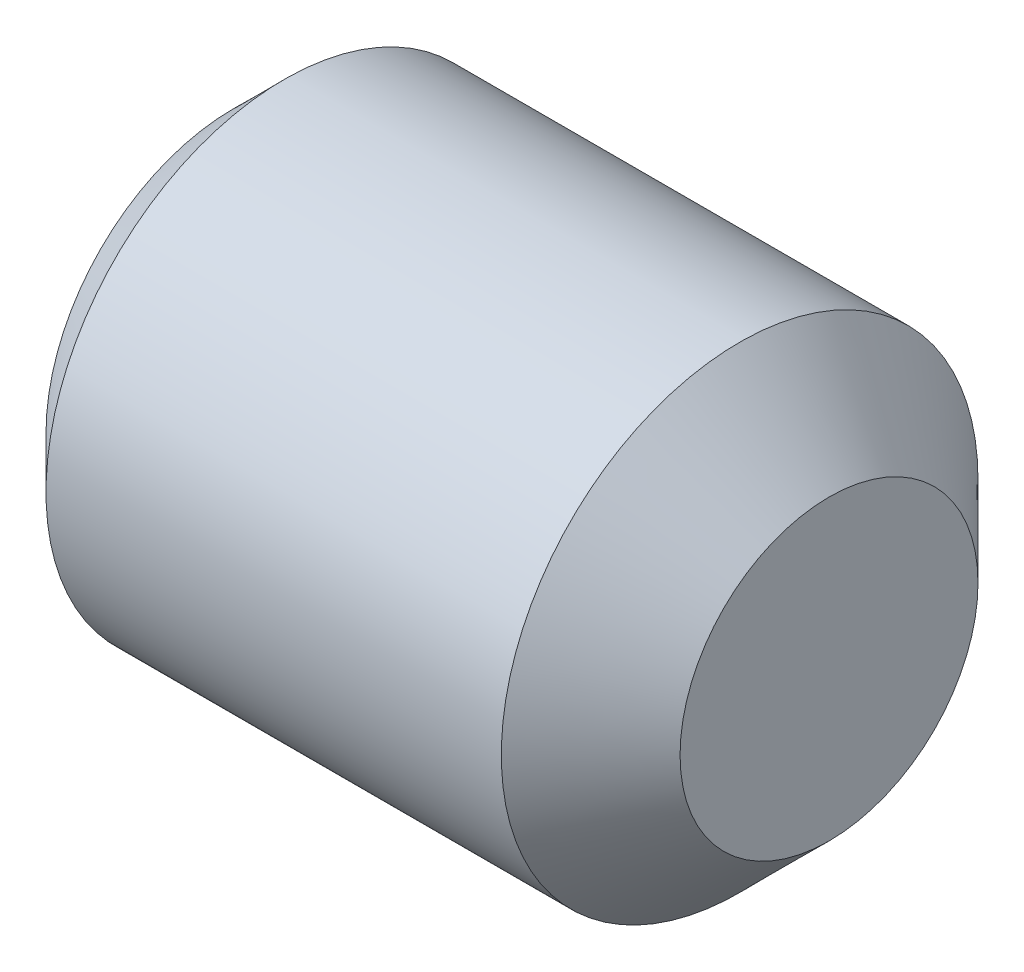
ISO-10303-21;
HEADER;
FILE_DESCRIPTION(('STEP AP214'),'2;1');
FILE_NAME('part.step','',(''),(''),'','','');
FILE_SCHEMA(('AUTOMOTIVE_DESIGN { 1 0 10303 214 1 1 1 1 }'));
ENDSEC;
DATA;
#1=APPLICATION_CONTEXT('core data for automotive mechanical design processes');
#2=APPLICATION_PROTOCOL_DEFINITION('international standard','automotive_design',2000,#1);
#3=PRODUCT_CONTEXT('',#1,'mechanical');
#4=PRODUCT('Part','Part','',(#3));
#5=PRODUCT_RELATED_PRODUCT_CATEGORY('part','',(#4));
#6=PRODUCT_DEFINITION_FORMATION('','',#4);
#7=PRODUCT_DEFINITION_CONTEXT('part definition',#1,'design');
#8=PRODUCT_DEFINITION('design','',#6,#7);
#9=PRODUCT_DEFINITION_SHAPE('','',#8);
#10=(LENGTH_UNIT() NAMED_UNIT(*) SI_UNIT(.MILLI.,.METRE.));
#11=(NAMED_UNIT(*) PLANE_ANGLE_UNIT() SI_UNIT($,.RADIAN.));
#12=(NAMED_UNIT(*) SI_UNIT($,.STERADIAN.) SOLID_ANGLE_UNIT());
#13=UNCERTAINTY_MEASURE_WITH_UNIT(LENGTH_MEASURE(1.E-05),#10,'distance_accuracy_value','');
#14=(GEOMETRIC_REPRESENTATION_CONTEXT(3) GLOBAL_UNCERTAINTY_ASSIGNED_CONTEXT((#13)) GLOBAL_UNIT_ASSIGNED_CONTEXT((#10,
#11,#12)) REPRESENTATION_CONTEXT('',''));
#15=CARTESIAN_POINT('',(0.,0.,0.));
#16=DIRECTION('',(0.,0.,1.));
#17=DIRECTION('',(1.,0.,0.));
#18=AXIS2_PLACEMENT_3D('',#15,#16,#17);
#19=CARTESIAN_POINT('',(0.,0.,0.));
#20=DIRECTION('',(1.,0.,0.));
#21=DIRECTION('',(0.,1.,0.));
#22=AXIS2_PLACEMENT_3D('',#19,#20,#21);
#23=PLANE('',#22);
#24=CARTESIAN_POINT('',(0.,0.,0.));
#25=DIRECTION('',(-1.,0.,0.));
#26=DIRECTION('',(0.,0.,-1.));
#27=AXIS2_PLACEMENT_3D('',#24,#25,#26);
#28=CIRCLE('',#27,1.);
#29=CARTESIAN_POINT('',(0.,-0.866025403784439,-0.5));
#30=VERTEX_POINT('',#29);
#31=CARTESIAN_POINT('',(0.,-0.866025403784439,0.5));
#32=VERTEX_POINT('',#31);
#33=EDGE_CURVE('E41',#30,#32,#28,.T.);
#34=ORIENTED_EDGE('',*,*,#33,.F.);
#35=DIRECTION('',(0.,0.5,-0.866025403784439));
#36=VECTOR('',#35,1.);
#37=CARTESIAN_POINT('',(0.,-1.15470053837925,0.));
#38=LINE('',#37,#36);
#39=CARTESIAN_POINT('',(0.,-1.15470053837925,0.));
#40=VERTEX_POINT('',#39);
#41=EDGE_CURVE('E20',#40,#30,#38,.T.);
#42=ORIENTED_EDGE('',*,*,#41,.F.);
#43=DIRECTION('',(0.,-0.5,-0.866025403784439));
#44=VECTOR('',#43,1.);
#45=CARTESIAN_POINT('',(0.,-0.577350269189626,1.));
#46=LINE('',#45,#44);
#47=EDGE_CURVE('E183',#32,#40,#46,.T.);
#48=ORIENTED_EDGE('',*,*,#47,.F.);
#49=EDGE_LOOP('',(#34,#42,#48));
#50=FACE_BOUND('',#49,.T.);
#51=ADVANCED_FACE('F16',(#50),#23,.F.);
#52=CARTESIAN_POINT('',(0.,0.,0.));
#53=DIRECTION('',(1.,0.,0.));
#54=DIRECTION('',(0.,1.,0.));
#55=AXIS2_PLACEMENT_3D('',#52,#53,#54);
#56=PLANE('',#55);
#57=CARTESIAN_POINT('',(0.,0.,0.));
#58=DIRECTION('',(-1.,0.,0.));
#59=DIRECTION('',(0.,0.,-1.));
#60=AXIS2_PLACEMENT_3D('',#57,#58,#59);
#61=CIRCLE('',#60,1.);
#62=CARTESIAN_POINT('',(0.,0.,1.));
#63=VERTEX_POINT('',#62);
#64=EDGE_CURVE('E172',#32,#63,#61,.T.);
#65=ORIENTED_EDGE('',*,*,#64,.F.);
#66=DIRECTION('',(0.,-0.5,-0.866025403784439));
#67=VECTOR('',#66,1.);
#68=CARTESIAN_POINT('',(0.,-0.577350269189626,1.));
#69=LINE('',#68,#67);
#70=CARTESIAN_POINT('',(0.,-0.577350269189626,1.));
#71=VERTEX_POINT('',#70);
#72=EDGE_CURVE('E179',#71,#32,#69,.T.);
#73=ORIENTED_EDGE('',*,*,#72,.F.);
#74=DIRECTION('',(0.,-1.,0.));
#75=VECTOR('',#74,1.);
#76=CARTESIAN_POINT('',(0.,0.577350269189626,1.));
#77=LINE('',#76,#75);
#78=EDGE_CURVE('E193',#63,#71,#77,.T.);
#79=ORIENTED_EDGE('',*,*,#78,.F.);
#80=EDGE_LOOP('',(#65,#73,#79));
#81=FACE_BOUND('',#80,.T.);
#82=ADVANCED_FACE('F428',(#81),#56,.F.);
#83=CARTESIAN_POINT('',(0.,0.,0.));
#84=DIRECTION('',(1.,0.,0.));
#85=DIRECTION('',(0.,1.,0.));
#86=AXIS2_PLACEMENT_3D('',#83,#84,#85);
#87=PLANE('',#86);
#88=CARTESIAN_POINT('',(0.,0.,0.));
#89=DIRECTION('',(-1.,0.,0.));
#90=DIRECTION('',(0.,0.,-1.));
#91=AXIS2_PLACEMENT_3D('',#88,#89,#90);
#92=CIRCLE('',#91,1.);
#93=CARTESIAN_POINT('',(0.,0.866025403784439,0.5));
#94=VERTEX_POINT('',#93);
#95=EDGE_CURVE('E199',#63,#94,#92,.T.);
#96=ORIENTED_EDGE('',*,*,#95,.F.);
#97=DIRECTION('',(0.,-1.,0.));
#98=VECTOR('',#97,1.);
#99=CARTESIAN_POINT('',(0.,0.577350269189626,1.));
#100=LINE('',#99,#98);
#101=CARTESIAN_POINT('',(0.,0.577350269189626,1.));
#102=VERTEX_POINT('',#101);
#103=EDGE_CURVE('E188',#102,#63,#100,.T.);
#104=ORIENTED_EDGE('',*,*,#103,.F.);
#105=DIRECTION('',(0.,-0.5,0.866025403784439));
#106=VECTOR('',#105,1.);
#107=CARTESIAN_POINT('',(0.,1.15470053837925,0.));
#108=LINE('',#107,#106);
#109=EDGE_CURVE('E138',#94,#102,#108,.T.);
#110=ORIENTED_EDGE('',*,*,#109,.F.);
#111=EDGE_LOOP('',(#96,#104,#110));
#112=FACE_BOUND('',#111,.T.);
#113=ADVANCED_FACE('F423',(#112),#87,.F.);
#114=CARTESIAN_POINT('',(0.,0.,0.));
#115=DIRECTION('',(1.,0.,0.));
#116=DIRECTION('',(0.,1.,0.));
#117=AXIS2_PLACEMENT_3D('',#114,#115,#116);
#118=PLANE('',#117);
#119=CARTESIAN_POINT('',(0.,0.,0.));
#120=DIRECTION('',(-1.,0.,0.));
#121=DIRECTION('',(0.,0.,-1.));
#122=AXIS2_PLACEMENT_3D('',#119,#120,#121);
#123=CIRCLE('',#122,1.);
#124=CARTESIAN_POINT('',(0.,0.866025403784439,-0.5));
#125=VERTEX_POINT('',#124);
#126=EDGE_CURVE('E131',#94,#125,#123,.T.);
#127=ORIENTED_EDGE('',*,*,#126,.F.);
#128=DIRECTION('',(0.,-0.5,0.866025403784439));
#129=VECTOR('',#128,1.);
#130=CARTESIAN_POINT('',(0.,1.15470053837925,0.));
#131=LINE('',#130,#129);
#132=CARTESIAN_POINT('',(0.,1.15470053837925,0.));
#133=VERTEX_POINT('',#132);
#134=EDGE_CURVE('E126',#133,#94,#131,.T.);
#135=ORIENTED_EDGE('',*,*,#134,.F.);
#136=DIRECTION('',(0.,0.5,0.866025403784439));
#137=VECTOR('',#136,1.);
#138=CARTESIAN_POINT('',(0.,0.577350269189626,-1.));
#139=LINE('',#138,#137);
#140=EDGE_CURVE('E129',#125,#133,#139,.T.);
#141=ORIENTED_EDGE('',*,*,#140,.F.);
#142=EDGE_LOOP('',(#127,#135,#141));
#143=FACE_BOUND('',#142,.T.);
#144=ADVANCED_FACE('F128',(#143),#118,.F.);
#145=CARTESIAN_POINT('',(0.,0.,0.));
#146=DIRECTION('',(1.,0.,0.));
#147=DIRECTION('',(0.,1.,0.));
#148=AXIS2_PLACEMENT_3D('',#145,#146,#147);
#149=PLANE('',#148);
#150=CARTESIAN_POINT('',(0.,0.,0.));
#151=DIRECTION('',(-1.,0.,0.));
#152=DIRECTION('',(0.,0.,-1.));
#153=AXIS2_PLACEMENT_3D('',#150,#151,#152);
#154=CIRCLE('',#153,1.);
#155=CARTESIAN_POINT('',(0.,0.,-1.));
#156=VERTEX_POINT('',#155);
#157=EDGE_CURVE('E235',#156,#30,#154,.T.);
#158=ORIENTED_EDGE('',*,*,#157,.F.);
#159=DIRECTION('',(0.,1.,0.));
#160=VECTOR('',#159,1.);
#161=CARTESIAN_POINT('',(0.,-0.577350269189626,-1.));
#162=LINE('',#161,#160);
#163=CARTESIAN_POINT('',(0.,-0.577350269189626,-1.));
#164=VERTEX_POINT('',#163);
#165=EDGE_CURVE('E161',#164,#156,#162,.T.);
#166=ORIENTED_EDGE('',*,*,#165,.F.);
#167=DIRECTION('',(0.,0.5,-0.866025403784439));
#168=VECTOR('',#167,1.);
#169=CARTESIAN_POINT('',(0.,-1.15470053837925,0.));
#170=LINE('',#169,#168);
#171=EDGE_CURVE('E204',#30,#164,#170,.T.);
#172=ORIENTED_EDGE('',*,*,#171,.F.);
#173=EDGE_LOOP('',(#158,#166,#172));
#174=FACE_BOUND('',#173,.T.);
#175=ADVANCED_FACE('F399',(#174),#149,.F.);
#176=CARTESIAN_POINT('',(-2.5,0.,0.));
#177=DIRECTION('',(1.,0.,0.));
#178=DIRECTION('',(0.,1.,0.));
#179=AXIS2_PLACEMENT_3D('',#176,#177,#178);
#180=PLANE('',#179);
#181=CARTESIAN_POINT('',(-2.5,0.,0.));
#182=DIRECTION('',(1.,0.,0.));
#183=DIRECTION('',(0.,0.,-1.));
#184=AXIS2_PLACEMENT_3D('',#181,#182,#183);
#185=CIRCLE('',#184,1.5705);
#186=CARTESIAN_POINT('',(-2.5,0.,-1.5705));
#187=VERTEX_POINT('',#186);
#188=EDGE_CURVE('E167',#187,#187,#185,.T.);
#189=ORIENTED_EDGE('',*,*,#188,.F.);
#190=EDGE_LOOP('',(#189));
#191=FACE_BOUND('',#190,.T.);
#192=DIRECTION('',(0.,-1.,0.));
#193=VECTOR('',#192,1.);
#194=CARTESIAN_POINT('',(-2.5,0.577350269189626,1.));
#195=LINE('',#194,#193);
#196=CARTESIAN_POINT('',(-2.5,0.577350269189626,1.));
#197=VERTEX_POINT('',#196);
#198=CARTESIAN_POINT('',(-2.5,-0.577350269189626,1.));
#199=VERTEX_POINT('',#198);
#200=EDGE_CURVE('E11',#197,#199,#195,.T.);
#201=ORIENTED_EDGE('',*,*,#200,.T.);
#202=DIRECTION('',(0.,-0.5,-0.866025403784439));
#203=VECTOR('',#202,1.);
#204=CARTESIAN_POINT('',(-2.5,-0.577350269189626,1.));
#205=LINE('',#204,#203);
#206=CARTESIAN_POINT('',(-2.5,-1.15470053837925,0.));
#207=VERTEX_POINT('',#206);
#208=EDGE_CURVE('E27',#199,#207,#205,.T.);
#209=ORIENTED_EDGE('',*,*,#208,.T.);
#210=DIRECTION('',(0.,0.5,-0.866025403784439));
#211=VECTOR('',#210,1.);
#212=CARTESIAN_POINT('',(-2.5,-1.15470053837925,0.));
#213=LINE('',#212,#211);
#214=CARTESIAN_POINT('',(-2.5,-0.577350269189626,-1.));
#215=VERTEX_POINT('',#214);
#216=EDGE_CURVE('E223',#207,#215,#213,.T.);
#217=ORIENTED_EDGE('',*,*,#216,.T.);
#218=DIRECTION('',(0.,1.,0.));
#219=VECTOR('',#218,1.);
#220=CARTESIAN_POINT('',(-2.5,-0.577350269189626,-1.));
#221=LINE('',#220,#219);
#222=CARTESIAN_POINT('',(-2.5,0.577350269189626,-1.));
#223=VERTEX_POINT('',#222);
#224=EDGE_CURVE('E219',#215,#223,#221,.T.);
#225=ORIENTED_EDGE('',*,*,#224,.T.);
#226=DIRECTION('',(0.,0.5,0.866025403784439));
#227=VECTOR('',#226,1.);
#228=CARTESIAN_POINT('',(-2.5,0.577350269189626,-1.));
#229=LINE('',#228,#227);
#230=CARTESIAN_POINT('',(-2.5,1.15470053837925,0.));
#231=VERTEX_POINT('',#230);
#232=EDGE_CURVE('E224',#223,#231,#229,.T.);
#233=ORIENTED_EDGE('',*,*,#232,.T.);
#234=DIRECTION('',(0.,-0.5,0.866025403784439));
#235=VECTOR('',#234,1.);
#236=CARTESIAN_POINT('',(-2.5,1.15470053837925,0.));
#237=LINE('',#236,#235);
#238=EDGE_CURVE('E150',#231,#197,#237,.T.);
#239=ORIENTED_EDGE('',*,*,#238,.T.);
#240=EDGE_LOOP('',(#201,#209,#217,#225,#233,#239));
#241=FACE_BOUND('',#240,.T.);
#242=ADVANCED_FACE('F260',(#191,#241),#180,.F.);
#243=CARTESIAN_POINT('',(-2.5,0.,0.));
#244=DIRECTION('',(1.,0.,0.));
#245=DIRECTION('',(0.,0.,-1.));
#246=AXIS2_PLACEMENT_3D('',#243,#244,#245);
#247=CONICAL_SURFACE('',#246,1.5705,0.785398163397448);
#248=CARTESIAN_POINT('',(-2.0705,0.,0.));
#249=DIRECTION('',(1.,0.,0.));
#250=DIRECTION('',(0.,0.,-1.));
#251=AXIS2_PLACEMENT_3D('',#248,#249,#250);
#252=CIRCLE('',#251,2.);
#253=CARTESIAN_POINT('',(-2.0705,0.,-2.));
#254=VERTEX_POINT('',#253);
#255=EDGE_CURVE('E171',#254,#254,#252,.T.);
#256=ORIENTED_EDGE('',*,*,#255,.F.);
#257=EDGE_LOOP('',(#256));
#258=FACE_BOUND('',#257,.T.);
#259=ORIENTED_EDGE('',*,*,#188,.T.);
#260=EDGE_LOOP('',(#259));
#261=FACE_BOUND('',#260,.T.);
#262=ADVANCED_FACE('F18',(#258,#261),#247,.T.);
#263=CARTESIAN_POINT('',(2.5,0.,0.));
#264=DIRECTION('',(1.,0.,0.));
#265=DIRECTION('',(0.,0.,-1.));
#266=AXIS2_PLACEMENT_3D('',#263,#264,#265);
#267=CYLINDRICAL_SURFACE('',#266,2.);
#268=CARTESIAN_POINT('',(1.75,0.,0.));
#269=DIRECTION('',(1.,0.,0.));
#270=DIRECTION('',(0.,0.,-1.));
#271=AXIS2_PLACEMENT_3D('',#268,#269,#270);
#272=CIRCLE('',#271,2.);
#273=CARTESIAN_POINT('',(1.75,0.,-2.));
#274=VERTEX_POINT('',#273);
#275=EDGE_CURVE('E178',#274,#274,#272,.T.);
#276=ORIENTED_EDGE('',*,*,#275,.F.);
#277=EDGE_LOOP('',(#276));
#278=FACE_BOUND('',#277,.T.);
#279=ORIENTED_EDGE('',*,*,#255,.T.);
#280=EDGE_LOOP('',(#279));
#281=FACE_BOUND('',#280,.T.);
#282=ADVANCED_FACE('F373',(#278,#281),#267,.T.);
#283=CARTESIAN_POINT('',(1.75,0.,0.));
#284=DIRECTION('',(-1.,0.,0.));
#285=DIRECTION('',(0.,0.,1.));
#286=AXIS2_PLACEMENT_3D('',#283,#284,#285);
#287=CONICAL_SURFACE('',#286,2.,0.785398163397449);
#288=CARTESIAN_POINT('',(2.5,0.,0.));
#289=DIRECTION('',(1.,0.,0.));
#290=DIRECTION('',(0.,0.,-1.));
#291=AXIS2_PLACEMENT_3D('',#288,#289,#290);
#292=CIRCLE('',#291,1.25);
#293=CARTESIAN_POINT('',(2.5,0.,-1.25));
#294=VERTEX_POINT('',#293);
#295=EDGE_CURVE('E192',#294,#294,#292,.T.);
#296=ORIENTED_EDGE('',*,*,#295,.F.);
#297=EDGE_LOOP('',(#296));
#298=FACE_BOUND('',#297,.T.);
#299=ORIENTED_EDGE('',*,*,#275,.T.);
#300=EDGE_LOOP('',(#299));
#301=FACE_BOUND('',#300,.T.);
#302=ADVANCED_FACE('F390',(#298,#301),#287,.T.);
#303=CARTESIAN_POINT('',(2.5,1.25,0.));
#304=DIRECTION('',(-1.,0.,0.));
#305=DIRECTION('',(0.,0.,1.));
#306=AXIS2_PLACEMENT_3D('',#303,#304,#305);
#307=PLANE('',#306);
#308=ORIENTED_EDGE('',*,*,#295,.T.);
#309=EDGE_LOOP('',(#308));
#310=FACE_BOUND('',#309,.T.);
#311=ADVANCED_FACE('F448',(#310),#307,.F.);
#312=CARTESIAN_POINT('',(0.,0.577350269189626,1.));
#313=DIRECTION('',(0.,0.,-1.));
#314=DIRECTION('',(0.,-1.,0.));
#315=AXIS2_PLACEMENT_3D('',#312,#313,#314);
#316=PLANE('',#315);
#317=ORIENTED_EDGE('',*,*,#200,.F.);
#318=DIRECTION('',(-1.,0.,0.));
#319=VECTOR('',#318,1.);
#320=CARTESIAN_POINT('',(0.,0.577350269189626,1.));
#321=LINE('',#320,#319);
#322=EDGE_CURVE('E213',#102,#197,#321,.T.);
#323=ORIENTED_EDGE('',*,*,#322,.F.);
#324=ORIENTED_EDGE('',*,*,#103,.T.);
#325=ORIENTED_EDGE('',*,*,#78,.T.);
#326=DIRECTION('',(-1.,0.,0.));
#327=VECTOR('',#326,1.);
#328=CARTESIAN_POINT('',(0.,-0.577350269189626,1.));
#329=LINE('',#328,#327);
#330=EDGE_CURVE('E159',#71,#199,#329,.T.);
#331=ORIENTED_EDGE('',*,*,#330,.T.);
#332=EDGE_LOOP('',(#317,#323,#324,#325,#331));
#333=FACE_BOUND('',#332,.T.);
#334=ADVANCED_FACE('F465',(#333),#316,.T.);
#335=CARTESIAN_POINT('',(0.,-0.577350269189626,1.));
#336=DIRECTION('',(0.,0.866025403784439,-0.5));
#337=DIRECTION('',(-1.,0.,0.));
#338=AXIS2_PLACEMENT_3D('',#335,#336,#337);
#339=PLANE('',#338);
#340=ORIENTED_EDGE('',*,*,#208,.F.);
#341=ORIENTED_EDGE('',*,*,#330,.F.);
#342=ORIENTED_EDGE('',*,*,#72,.T.);
#343=ORIENTED_EDGE('',*,*,#47,.T.);
#344=DIRECTION('',(-1.,0.,0.));
#345=VECTOR('',#344,1.);
#346=CARTESIAN_POINT('',(0.,-1.15470053837925,0.));
#347=LINE('',#346,#345);
#348=EDGE_CURVE('E187',#40,#207,#347,.T.);
#349=ORIENTED_EDGE('',*,*,#348,.T.);
#350=EDGE_LOOP('',(#340,#341,#342,#343,#349));
#351=FACE_BOUND('',#350,.T.);
#352=ADVANCED_FACE('F415',(#351),#339,.T.);
#353=CARTESIAN_POINT('',(0.,-1.15470053837925,0.));
#354=DIRECTION('',(0.,0.866025403784439,0.5));
#355=DIRECTION('',(1.,0.,0.));
#356=AXIS2_PLACEMENT_3D('',#353,#354,#355);
#357=PLANE('',#356);
#358=ORIENTED_EDGE('',*,*,#216,.F.);
#359=ORIENTED_EDGE('',*,*,#348,.F.);
#360=ORIENTED_EDGE('',*,*,#41,.T.);
#361=ORIENTED_EDGE('',*,*,#171,.T.);
#362=DIRECTION('',(-1.,0.,0.));
#363=VECTOR('',#362,1.);
#364=CARTESIAN_POINT('',(0.,-0.577350269189626,-1.));
#365=LINE('',#364,#363);
#366=EDGE_CURVE('E164',#164,#215,#365,.T.);
#367=ORIENTED_EDGE('',*,*,#366,.T.);
#368=EDGE_LOOP('',(#358,#359,#360,#361,#367));
#369=FACE_BOUND('',#368,.T.);
#370=ADVANCED_FACE('F265',(#369),#357,.T.);
#371=CARTESIAN_POINT('',(0.,-0.577350269189626,-1.));
#372=DIRECTION('',(0.,0.,1.));
#373=DIRECTION('',(1.,0.,0.));
#374=AXIS2_PLACEMENT_3D('',#371,#372,#373);
#375=PLANE('',#374);
#376=ORIENTED_EDGE('',*,*,#224,.F.);
#377=ORIENTED_EDGE('',*,*,#366,.F.);
#378=ORIENTED_EDGE('',*,*,#165,.T.);
#379=DIRECTION('',(0.,1.,0.));
#380=VECTOR('',#379,1.);
#381=CARTESIAN_POINT('',(0.,-0.577350269189626,-1.));
#382=LINE('',#381,#380);
#383=CARTESIAN_POINT('',(0.,0.577350269189626,-1.));
#384=VERTEX_POINT('',#383);
#385=EDGE_CURVE('E165',#156,#384,#382,.T.);
#386=ORIENTED_EDGE('',*,*,#385,.T.);
#387=DIRECTION('',(-1.,0.,0.));
#388=VECTOR('',#387,1.);
#389=CARTESIAN_POINT('',(0.,0.577350269189626,-1.));
#390=LINE('',#389,#388);
#391=EDGE_CURVE('E195',#384,#223,#390,.T.);
#392=ORIENTED_EDGE('',*,*,#391,.T.);
#393=EDGE_LOOP('',(#376,#377,#378,#386,#392));
#394=FACE_BOUND('',#393,.T.);
#395=ADVANCED_FACE('F268',(#394),#375,.T.);
#396=CARTESIAN_POINT('',(0.,0.577350269189626,-1.));
#397=DIRECTION('',(0.,-0.866025403784439,0.5));
#398=DIRECTION('',(-1.,0.,0.));
#399=AXIS2_PLACEMENT_3D('',#396,#397,#398);
#400=PLANE('',#399);
#401=ORIENTED_EDGE('',*,*,#232,.F.);
#402=ORIENTED_EDGE('',*,*,#391,.F.);
#403=DIRECTION('',(0.,0.5,0.866025403784439));
#404=VECTOR('',#403,1.);
#405=CARTESIAN_POINT('',(0.,0.577350269189626,-1.));
#406=LINE('',#405,#404);
#407=EDGE_CURVE('E144',#384,#125,#406,.T.);
#408=ORIENTED_EDGE('',*,*,#407,.T.);
#409=ORIENTED_EDGE('',*,*,#140,.T.);
#410=DIRECTION('',(-1.,0.,0.));
#411=VECTOR('',#410,1.);
#412=CARTESIAN_POINT('',(0.,1.15470053837925,0.));
#413=LINE('',#412,#411);
#414=EDGE_CURVE('E137',#133,#231,#413,.T.);
#415=ORIENTED_EDGE('',*,*,#414,.T.);
#416=EDGE_LOOP('',(#401,#402,#408,#409,#415));
#417=FACE_BOUND('',#416,.T.);
#418=ADVANCED_FACE('F142',(#417),#400,.T.);
#419=CARTESIAN_POINT('',(0.,1.15470053837925,0.));
#420=DIRECTION('',(0.,-0.866025403784439,-0.5));
#421=DIRECTION('',(0.,0.5,-0.866025403784439));
#422=AXIS2_PLACEMENT_3D('',#419,#420,#421);
#423=PLANE('',#422);
#424=ORIENTED_EDGE('',*,*,#238,.F.);
#425=ORIENTED_EDGE('',*,*,#414,.F.);
#426=ORIENTED_EDGE('',*,*,#134,.T.);
#427=ORIENTED_EDGE('',*,*,#109,.T.);
#428=ORIENTED_EDGE('',*,*,#322,.T.);
#429=EDGE_LOOP('',(#424,#425,#426,#427,#428));
#430=FACE_BOUND('',#429,.T.);
#431=ADVANCED_FACE('F148',(#430),#423,.T.);
#432=CARTESIAN_POINT('',(0.,0.,0.));
#433=DIRECTION('',(1.,0.,0.));
#434=DIRECTION('',(0.,1.,0.));
#435=AXIS2_PLACEMENT_3D('',#432,#433,#434);
#436=PLANE('',#435);
#437=CARTESIAN_POINT('',(0.,0.,0.));
#438=DIRECTION('',(-1.,0.,0.));
#439=DIRECTION('',(0.,0.,-1.));
#440=AXIS2_PLACEMENT_3D('',#437,#438,#439);
#441=CIRCLE('',#440,1.);
#442=EDGE_CURVE('E200',#125,#156,#441,.T.);
#443=ORIENTED_EDGE('',*,*,#442,.F.);
#444=ORIENTED_EDGE('',*,*,#407,.F.);
#445=ORIENTED_EDGE('',*,*,#385,.F.);
#446=EDGE_LOOP('',(#443,#444,#445));
#447=FACE_BOUND('',#446,.T.);
#448=ADVANCED_FACE('F378',(#447),#436,.F.);
#449=CARTESIAN_POINT('',(0.,0.,0.));
#450=DIRECTION('',(-1.,0.,0.));
#451=DIRECTION('',(0.,0.,1.));
#452=AXIS2_PLACEMENT_3D('',#449,#450,#451);
#453=CONICAL_SURFACE('',#452,1.,1.0471975511966);
#454=CARTESIAN_POINT('',(0.577350269189626,0.,0.));
#455=VERTEX_POINT('',#454);
#456=VERTEX_LOOP('',#455);
#457=FACE_BOUND('',#456,.T.);
#458=ORIENTED_EDGE('',*,*,#95,.T.);
#459=ORIENTED_EDGE('',*,*,#126,.T.);
#460=ORIENTED_EDGE('',*,*,#442,.T.);
#461=ORIENTED_EDGE('',*,*,#157,.T.);
#462=ORIENTED_EDGE('',*,*,#33,.T.);
#463=ORIENTED_EDGE('',*,*,#64,.T.);
#464=EDGE_LOOP('',(#458,#459,#460,#461,#462,#463));
#465=FACE_BOUND('',#464,.T.);
#466=ADVANCED_FACE('F382',(#457,#465),#453,.F.);
#467=CLOSED_SHELL('',(#51,#82,#113,#144,#175,#242,#262,#282,#302,#311,#334,#352,#370,#395,#418,
#431,#448,#466));
#468=MANIFOLD_SOLID_BREP('B1',#467);
#469=ADVANCED_BREP_SHAPE_REPRESENTATION('',(#18,#468),#14);
#470=SHAPE_DEFINITION_REPRESENTATION(#9,#469);
ENDSEC;
END-ISO-10303-21;
